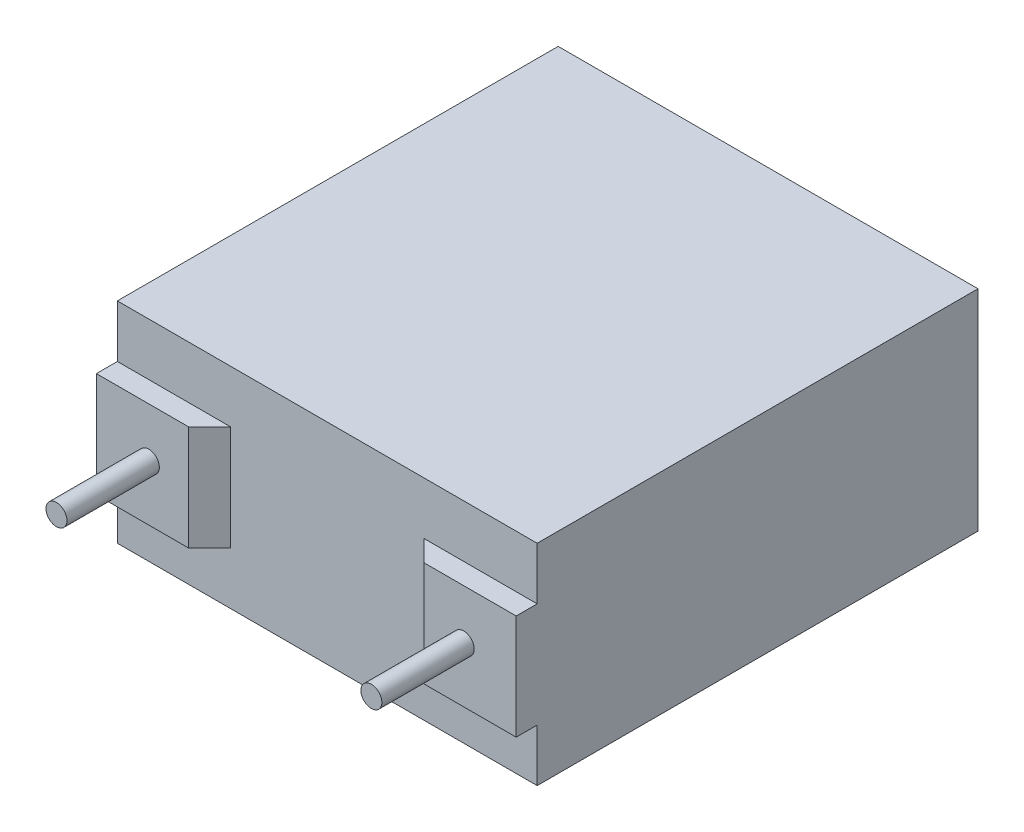
ISO-10303-21;
HEADER;
FILE_DESCRIPTION(('STEP AP214'),'2;1');
FILE_NAME('part.step','',(''),(''),'','','');
FILE_SCHEMA(('AUTOMOTIVE_DESIGN { 1 0 10303 214 1 1 1 1 }'));
ENDSEC;
DATA;
#1=APPLICATION_CONTEXT('core data for automotive mechanical design processes');
#2=APPLICATION_PROTOCOL_DEFINITION('international standard','automotive_design',2000,#1);
#3=PRODUCT_CONTEXT('',#1,'mechanical');
#4=PRODUCT('Part','Part','',(#3));
#5=PRODUCT_RELATED_PRODUCT_CATEGORY('part','',(#4));
#6=PRODUCT_DEFINITION_FORMATION('','',#4);
#7=PRODUCT_DEFINITION_CONTEXT('part definition',#1,'design');
#8=PRODUCT_DEFINITION('design','',#6,#7);
#9=PRODUCT_DEFINITION_SHAPE('','',#8);
#10=(LENGTH_UNIT() NAMED_UNIT(*) SI_UNIT(.MILLI.,.METRE.));
#11=(NAMED_UNIT(*) PLANE_ANGLE_UNIT() SI_UNIT($,.RADIAN.));
#12=(NAMED_UNIT(*) SI_UNIT($,.STERADIAN.) SOLID_ANGLE_UNIT());
#13=UNCERTAINTY_MEASURE_WITH_UNIT(LENGTH_MEASURE(1.E-05),#10,'distance_accuracy_value','');
#14=(GEOMETRIC_REPRESENTATION_CONTEXT(3) GLOBAL_UNCERTAINTY_ASSIGNED_CONTEXT((#13)) GLOBAL_UNIT_ASSIGNED_CONTEXT((#10,
#11,#12)) REPRESENTATION_CONTEXT('',''));
#15=CARTESIAN_POINT('',(0.,0.,0.));
#16=DIRECTION('',(0.,0.,1.));
#17=DIRECTION('',(1.,0.,0.));
#18=AXIS2_PLACEMENT_3D('',#15,#16,#17);
#19=CARTESIAN_POINT('',(5.,-1.25,0.5));
#20=DIRECTION('',(0.,0.,-1.));
#21=DIRECTION('',(-1.,0.,0.));
#22=AXIS2_PLACEMENT_3D('',#19,#20,#21);
#23=PLANE('',#22);
#24=DIRECTION('',(0.,1.,0.));
#25=VECTOR('',#24,1.);
#26=CARTESIAN_POINT('',(5.,1.25,0.5));
#27=LINE('',#26,#25);
#28=CARTESIAN_POINT('',(5.,-1.25,0.5));
#29=VERTEX_POINT('',#28);
#30=CARTESIAN_POINT('',(5.,1.25,0.5));
#31=VERTEX_POINT('',#30);
#32=EDGE_CURVE('E133',#29,#31,#27,.T.);
#33=ORIENTED_EDGE('',*,*,#32,.T.);
#34=DIRECTION('',(-1.,0.,0.));
#35=VECTOR('',#34,1.);
#36=CARTESIAN_POINT('',(5.,1.25,0.5));
#37=LINE('',#36,#35);
#38=CARTESIAN_POINT('',(2.8,1.25,0.5));
#39=VERTEX_POINT('',#38);
#40=EDGE_CURVE('E122',#31,#39,#37,.T.);
#41=ORIENTED_EDGE('',*,*,#40,.T.);
#42=DIRECTION('',(0.,-1.,0.));
#43=VECTOR('',#42,1.);
#44=CARTESIAN_POINT('',(2.8,1.25,0.5));
#45=LINE('',#44,#43);
#46=CARTESIAN_POINT('',(2.8,-1.25,0.5));
#47=VERTEX_POINT('',#46);
#48=EDGE_CURVE('E132',#39,#47,#45,.T.);
#49=ORIENTED_EDGE('',*,*,#48,.T.);
#50=DIRECTION('',(1.,0.,0.));
#51=VECTOR('',#50,1.);
#52=CARTESIAN_POINT('',(5.,-1.25,0.5));
#53=LINE('',#52,#51);
#54=EDGE_CURVE('E138',#47,#29,#53,.T.);
#55=ORIENTED_EDGE('',*,*,#54,.T.);
#56=EDGE_LOOP('',(#33,#41,#49,#55));
#57=FACE_BOUND('',#56,.T.);
#58=CARTESIAN_POINT('',(3.75,0.0659471881858112,0.5));
#59=DIRECTION('',(0.,0.,-1.));
#60=DIRECTION('',(-1.,0.,0.));
#61=AXIS2_PLACEMENT_3D('',#58,#59,#60);
#62=CIRCLE('',#61,0.25);
#63=CARTESIAN_POINT('',(3.5,0.0659471881858112,0.5));
#64=VERTEX_POINT('',#63);
#65=EDGE_CURVE('E11',#64,#64,#62,.F.);
#66=ORIENTED_EDGE('',*,*,#65,.F.);
#67=EDGE_LOOP('',(#66));
#68=FACE_BOUND('',#67,.T.);
#69=ADVANCED_FACE('F35',(#57,#68),#23,.F.);
#70=CARTESIAN_POINT('',(-5.,-1.25,0.5));
#71=DIRECTION('',(0.,0.,1.));
#72=DIRECTION('',(1.,0.,0.));
#73=AXIS2_PLACEMENT_3D('',#70,#71,#72);
#74=PLANE('',#73);
#75=DIRECTION('',(0.,-1.,0.));
#76=VECTOR('',#75,1.);
#77=CARTESIAN_POINT('',(-5.,1.25,0.5));
#78=LINE('',#77,#76);
#79=CARTESIAN_POINT('',(-5.,1.25,0.5));
#80=VERTEX_POINT('',#79);
#81=CARTESIAN_POINT('',(-5.,-1.25,0.5));
#82=VERTEX_POINT('',#81);
#83=EDGE_CURVE('E156',#80,#82,#78,.T.);
#84=ORIENTED_EDGE('',*,*,#83,.T.);
#85=DIRECTION('',(1.,0.,0.));
#86=VECTOR('',#85,1.);
#87=CARTESIAN_POINT('',(-5.,-1.25,0.5));
#88=LINE('',#87,#86);
#89=CARTESIAN_POINT('',(-2.8,-1.25,0.5));
#90=VERTEX_POINT('',#89);
#91=EDGE_CURVE('E159',#82,#90,#88,.T.);
#92=ORIENTED_EDGE('',*,*,#91,.T.);
#93=DIRECTION('',(0.,1.,0.));
#94=VECTOR('',#93,1.);
#95=CARTESIAN_POINT('',(-2.8,1.25,0.5));
#96=LINE('',#95,#94);
#97=CARTESIAN_POINT('',(-2.8,1.25,0.5));
#98=VERTEX_POINT('',#97);
#99=EDGE_CURVE('E162',#90,#98,#96,.T.);
#100=ORIENTED_EDGE('',*,*,#99,.T.);
#101=DIRECTION('',(-1.,0.,0.));
#102=VECTOR('',#101,1.);
#103=CARTESIAN_POINT('',(-5.,1.25,0.5));
#104=LINE('',#103,#102);
#105=EDGE_CURVE('E165',#98,#80,#104,.T.);
#106=ORIENTED_EDGE('',*,*,#105,.T.);
#107=EDGE_LOOP('',(#84,#92,#100,#106));
#108=FACE_BOUND('',#107,.T.);
#109=CARTESIAN_POINT('',(-3.75,0.0659471881858103,0.5));
#110=DIRECTION('',(0.,0.,1.));
#111=DIRECTION('',(1.,0.,0.));
#112=AXIS2_PLACEMENT_3D('',#109,#110,#111);
#113=CIRCLE('',#112,0.25);
#114=CARTESIAN_POINT('',(-3.5,0.0659471881858103,0.5));
#115=VERTEX_POINT('',#114);
#116=EDGE_CURVE('E455',#115,#115,#113,.T.);
#117=ORIENTED_EDGE('',*,*,#116,.F.);
#118=EDGE_LOOP('',(#117));
#119=FACE_BOUND('',#118,.T.);
#120=ADVANCED_FACE('F202',(#108,#119),#74,.T.);
#121=CARTESIAN_POINT('',(-5.,-2.5,0.));
#122=DIRECTION('',(0.,0.,1.));
#123=DIRECTION('',(1.,0.,0.));
#124=AXIS2_PLACEMENT_3D('',#121,#122,#123);
#125=PLANE('',#124);
#126=DIRECTION('',(1.,0.,0.));
#127=VECTOR('',#126,1.);
#128=CARTESIAN_POINT('',(5.,-1.25,0.));
#129=LINE('',#128,#127);
#130=CARTESIAN_POINT('',(2.3,-1.25,0.));
#131=VERTEX_POINT('',#130);
#132=CARTESIAN_POINT('',(5.,-1.25,0.));
#133=VERTEX_POINT('',#132);
#134=EDGE_CURVE('E50',#131,#133,#129,.T.);
#135=ORIENTED_EDGE('',*,*,#134,.F.);
#136=DIRECTION('',(0.,1.,0.));
#137=VECTOR('',#136,1.);
#138=CARTESIAN_POINT('',(2.3,-2.5,0.));
#139=LINE('',#138,#137);
#140=CARTESIAN_POINT('',(2.3,1.25,0.));
#141=VERTEX_POINT('',#140);
#142=EDGE_CURVE('E186',#131,#141,#139,.T.);
#143=ORIENTED_EDGE('',*,*,#142,.T.);
#144=DIRECTION('',(-1.,0.,0.));
#145=VECTOR('',#144,1.);
#146=CARTESIAN_POINT('',(5.,1.25,0.));
#147=LINE('',#146,#145);
#148=CARTESIAN_POINT('',(5.,1.25,0.));
#149=VERTEX_POINT('',#148);
#150=EDGE_CURVE('E58',#149,#141,#147,.T.);
#151=ORIENTED_EDGE('',*,*,#150,.F.);
#152=DIRECTION('',(0.,1.,0.));
#153=VECTOR('',#152,1.);
#154=CARTESIAN_POINT('',(5.,2.5,0.));
#155=LINE('',#154,#153);
#156=CARTESIAN_POINT('',(5.,2.5,0.));
#157=VERTEX_POINT('',#156);
#158=EDGE_CURVE('E147',#149,#157,#155,.T.);
#159=ORIENTED_EDGE('',*,*,#158,.T.);
#160=DIRECTION('',(-1.,0.,0.));
#161=VECTOR('',#160,1.);
#162=CARTESIAN_POINT('',(-5.,2.5,0.));
#163=LINE('',#162,#161);
#164=CARTESIAN_POINT('',(-5.,2.5,0.));
#165=VERTEX_POINT('',#164);
#166=EDGE_CURVE('E234',#157,#165,#163,.T.);
#167=ORIENTED_EDGE('',*,*,#166,.T.);
#168=DIRECTION('',(0.,-1.,0.));
#169=VECTOR('',#168,1.);
#170=CARTESIAN_POINT('',(-5.,2.5,0.));
#171=LINE('',#170,#169);
#172=CARTESIAN_POINT('',(-5.,1.25,0.));
#173=VERTEX_POINT('',#172);
#174=EDGE_CURVE('E216',#165,#173,#171,.T.);
#175=ORIENTED_EDGE('',*,*,#174,.T.);
#176=DIRECTION('',(-1.,0.,0.));
#177=VECTOR('',#176,1.);
#178=CARTESIAN_POINT('',(-5.,1.25,0.));
#179=LINE('',#178,#177);
#180=CARTESIAN_POINT('',(-2.3,1.25,0.));
#181=VERTEX_POINT('',#180);
#182=EDGE_CURVE('E151',#181,#173,#179,.T.);
#183=ORIENTED_EDGE('',*,*,#182,.F.);
#184=DIRECTION('',(0.,-1.,0.));
#185=VECTOR('',#184,1.);
#186=CARTESIAN_POINT('',(-2.3,-2.5,0.));
#187=LINE('',#186,#185);
#188=CARTESIAN_POINT('',(-2.3,-1.25,0.));
#189=VERTEX_POINT('',#188);
#190=EDGE_CURVE('E183',#181,#189,#187,.T.);
#191=ORIENTED_EDGE('',*,*,#190,.T.);
#192=DIRECTION('',(1.,0.,0.));
#193=VECTOR('',#192,1.);
#194=CARTESIAN_POINT('',(-5.,-1.25,0.));
#195=LINE('',#194,#193);
#196=CARTESIAN_POINT('',(-5.,-1.25,0.));
#197=VERTEX_POINT('',#196);
#198=EDGE_CURVE('E148',#197,#189,#195,.T.);
#199=ORIENTED_EDGE('',*,*,#198,.F.);
#200=CARTESIAN_POINT('',(-5.,-2.5,0.));
#201=VERTEX_POINT('',#200);
#202=EDGE_CURVE('E215',#197,#201,#171,.T.);
#203=ORIENTED_EDGE('',*,*,#202,.T.);
#204=DIRECTION('',(1.,0.,0.));
#205=VECTOR('',#204,1.);
#206=CARTESIAN_POINT('',(-5.,-2.5,0.));
#207=LINE('',#206,#205);
#208=CARTESIAN_POINT('',(5.,-2.5,0.));
#209=VERTEX_POINT('',#208);
#210=EDGE_CURVE('E228',#201,#209,#207,.T.);
#211=ORIENTED_EDGE('',*,*,#210,.T.);
#212=EDGE_CURVE('E232',#209,#133,#155,.T.);
#213=ORIENTED_EDGE('',*,*,#212,.T.);
#214=EDGE_LOOP('',(#135,#143,#151,#159,#167,#175,#183,#191,#199,#203,#211,#213));
#215=FACE_BOUND('',#214,.T.);
#216=ADVANCED_FACE('F272',(#215),#125,.T.);
#217=CARTESIAN_POINT('',(-5.,2.5,-10.5));
#218=DIRECTION('',(-1.,0.,0.));
#219=DIRECTION('',(0.,-1.,0.));
#220=AXIS2_PLACEMENT_3D('',#217,#218,#219);
#221=PLANE('',#220);
#222=ORIENTED_EDGE('',*,*,#174,.F.);
#223=DIRECTION('',(0.,0.,1.));
#224=VECTOR('',#223,1.);
#225=CARTESIAN_POINT('',(-5.,2.5,-10.5));
#226=LINE('',#225,#224);
#227=CARTESIAN_POINT('',(-5.,2.5,-10.5));
#228=VERTEX_POINT('',#227);
#229=EDGE_CURVE('E187',#228,#165,#226,.T.);
#230=ORIENTED_EDGE('',*,*,#229,.F.);
#231=DIRECTION('',(0.,-1.,0.));
#232=VECTOR('',#231,1.);
#233=CARTESIAN_POINT('',(-5.,2.5,-10.5));
#234=LINE('',#233,#232);
#235=CARTESIAN_POINT('',(-5.,-2.5,-10.5));
#236=VERTEX_POINT('',#235);
#237=EDGE_CURVE('E170',#228,#236,#234,.T.);
#238=ORIENTED_EDGE('',*,*,#237,.T.);
#239=DIRECTION('',(0.,0.,1.));
#240=VECTOR('',#239,1.);
#241=CARTESIAN_POINT('',(-5.,-2.5,-10.5));
#242=LINE('',#241,#240);
#243=EDGE_CURVE('E241',#236,#201,#242,.T.);
#244=ORIENTED_EDGE('',*,*,#243,.T.);
#245=ORIENTED_EDGE('',*,*,#202,.F.);
#246=DIRECTION('',(0.,0.,-1.));
#247=VECTOR('',#246,1.);
#248=CARTESIAN_POINT('',(-5.,-1.25,0.5));
#249=LINE('',#248,#247);
#250=EDGE_CURVE('E180',#82,#197,#249,.T.);
#251=ORIENTED_EDGE('',*,*,#250,.F.);
#252=ORIENTED_EDGE('',*,*,#83,.F.);
#253=DIRECTION('',(0.,0.,-1.));
#254=VECTOR('',#253,1.);
#255=CARTESIAN_POINT('',(-5.,1.25,0.5));
#256=LINE('',#255,#254);
#257=EDGE_CURVE('E167',#80,#173,#256,.T.);
#258=ORIENTED_EDGE('',*,*,#257,.T.);
#259=EDGE_LOOP('',(#222,#230,#238,#244,#245,#251,#252,#258));
#260=FACE_BOUND('',#259,.T.);
#261=ADVANCED_FACE('F212',(#260),#221,.T.);
#262=CARTESIAN_POINT('',(-5.,2.5,-10.5));
#263=DIRECTION('',(0.,1.,0.));
#264=DIRECTION('',(-1.,0.,0.));
#265=AXIS2_PLACEMENT_3D('',#262,#263,#264);
#266=PLANE('',#265);
#267=ORIENTED_EDGE('',*,*,#166,.F.);
#268=DIRECTION('',(0.,0.,1.));
#269=VECTOR('',#268,1.);
#270=CARTESIAN_POINT('',(5.,2.5,-10.5));
#271=LINE('',#270,#269);
#272=CARTESIAN_POINT('',(5.,2.5,-10.5));
#273=VERTEX_POINT('',#272);
#274=EDGE_CURVE('E238',#273,#157,#271,.T.);
#275=ORIENTED_EDGE('',*,*,#274,.F.);
#276=DIRECTION('',(-1.,0.,0.));
#277=VECTOR('',#276,1.);
#278=CARTESIAN_POINT('',(-5.,2.5,-10.5));
#279=LINE('',#278,#277);
#280=EDGE_CURVE('E226',#273,#228,#279,.T.);
#281=ORIENTED_EDGE('',*,*,#280,.T.);
#282=ORIENTED_EDGE('',*,*,#229,.T.);
#283=EDGE_LOOP('',(#267,#275,#281,#282));
#284=FACE_BOUND('',#283,.T.);
#285=ADVANCED_FACE('F386',(#284),#266,.T.);
#286=CARTESIAN_POINT('',(5.,2.5,-10.5));
#287=DIRECTION('',(1.,0.,0.));
#288=DIRECTION('',(0.,1.,0.));
#289=AXIS2_PLACEMENT_3D('',#286,#287,#288);
#290=PLANE('',#289);
#291=ORIENTED_EDGE('',*,*,#212,.F.);
#292=DIRECTION('',(0.,0.,1.));
#293=VECTOR('',#292,1.);
#294=CARTESIAN_POINT('',(5.,-2.5,-10.5));
#295=LINE('',#294,#293);
#296=CARTESIAN_POINT('',(5.,-2.5,-10.5));
#297=VERTEX_POINT('',#296);
#298=EDGE_CURVE('E240',#297,#209,#295,.T.);
#299=ORIENTED_EDGE('',*,*,#298,.F.);
#300=DIRECTION('',(0.,1.,0.));
#301=VECTOR('',#300,1.);
#302=CARTESIAN_POINT('',(5.,2.5,-10.5));
#303=LINE('',#302,#301);
#304=EDGE_CURVE('E245',#297,#273,#303,.T.);
#305=ORIENTED_EDGE('',*,*,#304,.T.);
#306=ORIENTED_EDGE('',*,*,#274,.T.);
#307=ORIENTED_EDGE('',*,*,#158,.F.);
#308=DIRECTION('',(0.,0.,-1.));
#309=VECTOR('',#308,1.);
#310=CARTESIAN_POINT('',(5.,1.25,0.5));
#311=LINE('',#310,#309);
#312=EDGE_CURVE('E126',#31,#149,#311,.T.);
#313=ORIENTED_EDGE('',*,*,#312,.F.);
#314=ORIENTED_EDGE('',*,*,#32,.F.);
#315=DIRECTION('',(0.,0.,-1.));
#316=VECTOR('',#315,1.);
#317=CARTESIAN_POINT('',(5.,-1.25,0.5));
#318=LINE('',#317,#316);
#319=EDGE_CURVE('E149',#29,#133,#318,.T.);
#320=ORIENTED_EDGE('',*,*,#319,.T.);
#321=EDGE_LOOP('',(#291,#299,#305,#306,#307,#313,#314,#320));
#322=FACE_BOUND('',#321,.T.);
#323=ADVANCED_FACE('F145',(#322),#290,.T.);
#324=CARTESIAN_POINT('',(-5.,-2.5,-10.5));
#325=DIRECTION('',(0.,-1.,0.));
#326=DIRECTION('',(1.,0.,0.));
#327=AXIS2_PLACEMENT_3D('',#324,#325,#326);
#328=PLANE('',#327);
#329=ORIENTED_EDGE('',*,*,#210,.F.);
#330=ORIENTED_EDGE('',*,*,#243,.F.);
#331=DIRECTION('',(1.,0.,0.));
#332=VECTOR('',#331,1.);
#333=CARTESIAN_POINT('',(-5.,-2.5,-10.5));
#334=LINE('',#333,#332);
#335=EDGE_CURVE('E249',#236,#297,#334,.T.);
#336=ORIENTED_EDGE('',*,*,#335,.T.);
#337=ORIENTED_EDGE('',*,*,#298,.T.);
#338=EDGE_LOOP('',(#329,#330,#336,#337));
#339=FACE_BOUND('',#338,.T.);
#340=ADVANCED_FACE('F258',(#339),#328,.T.);
#341=CARTESIAN_POINT('',(-5.,-2.5,-10.5));
#342=DIRECTION('',(0.,0.,1.));
#343=DIRECTION('',(1.,0.,0.));
#344=AXIS2_PLACEMENT_3D('',#341,#342,#343);
#345=PLANE('',#344);
#346=ORIENTED_EDGE('',*,*,#237,.F.);
#347=ORIENTED_EDGE('',*,*,#280,.F.);
#348=ORIENTED_EDGE('',*,*,#304,.F.);
#349=ORIENTED_EDGE('',*,*,#335,.F.);
#350=EDGE_LOOP('',(#346,#347,#348,#349));
#351=FACE_BOUND('',#350,.T.);
#352=ADVANCED_FACE('F256',(#351),#345,.F.);
#353=CARTESIAN_POINT('',(-5.,-1.25,0.5));
#354=DIRECTION('',(0.,1.,0.));
#355=DIRECTION('',(-1.,0.,0.));
#356=AXIS2_PLACEMENT_3D('',#353,#354,#355);
#357=PLANE('',#356);
#358=ORIENTED_EDGE('',*,*,#198,.T.);
#359=DIRECTION('',(-0.707106781186543,0.,0.707106781186552));
#360=VECTOR('',#359,1.);
#361=CARTESIAN_POINT('',(-3.89999999999998,-1.25,1.6));
#362=LINE('',#361,#360);
#363=EDGE_CURVE('E43',#189,#90,#362,.T.);
#364=ORIENTED_EDGE('',*,*,#363,.T.);
#365=ORIENTED_EDGE('',*,*,#91,.F.);
#366=ORIENTED_EDGE('',*,*,#250,.T.);
#367=EDGE_LOOP('',(#358,#364,#365,#366));
#368=FACE_BOUND('',#367,.T.);
#369=ADVANCED_FACE('F196',(#368),#357,.F.);
#370=CARTESIAN_POINT('',(-5.,1.25,0.5));
#371=DIRECTION('',(0.,-1.,0.));
#372=DIRECTION('',(0.,0.,-1.));
#373=AXIS2_PLACEMENT_3D('',#370,#371,#372);
#374=PLANE('',#373);
#375=ORIENTED_EDGE('',*,*,#182,.T.);
#376=ORIENTED_EDGE('',*,*,#257,.F.);
#377=ORIENTED_EDGE('',*,*,#105,.F.);
#378=DIRECTION('',(0.707106781186543,0.,-0.707106781186552));
#379=VECTOR('',#378,1.);
#380=CARTESIAN_POINT('',(-3.89999999999998,1.25,1.6));
#381=LINE('',#380,#379);
#382=EDGE_CURVE('E192',#98,#181,#381,.T.);
#383=ORIENTED_EDGE('',*,*,#382,.T.);
#384=EDGE_LOOP('',(#375,#376,#377,#383));
#385=FACE_BOUND('',#384,.T.);
#386=ADVANCED_FACE('F208',(#385),#374,.F.);
#387=CARTESIAN_POINT('',(5.,1.25,0.5));
#388=DIRECTION('',(0.,-1.,0.));
#389=DIRECTION('',(1.,0.,0.));
#390=AXIS2_PLACEMENT_3D('',#387,#388,#389);
#391=PLANE('',#390);
#392=ORIENTED_EDGE('',*,*,#150,.T.);
#393=DIRECTION('',(0.707106781186542,0.,0.707106781186553));
#394=VECTOR('',#393,1.);
#395=CARTESIAN_POINT('',(3.89999999999998,1.25,1.6));
#396=LINE('',#395,#394);
#397=EDGE_CURVE('E128',#141,#39,#396,.T.);
#398=ORIENTED_EDGE('',*,*,#397,.T.);
#399=ORIENTED_EDGE('',*,*,#40,.F.);
#400=ORIENTED_EDGE('',*,*,#312,.T.);
#401=EDGE_LOOP('',(#392,#398,#399,#400));
#402=FACE_BOUND('',#401,.T.);
#403=ADVANCED_FACE('F124',(#402),#391,.F.);
#404=CARTESIAN_POINT('',(5.,-1.25,0.5));
#405=DIRECTION('',(0.,1.,0.));
#406=DIRECTION('',(-1.,0.,0.));
#407=AXIS2_PLACEMENT_3D('',#404,#405,#406);
#408=PLANE('',#407);
#409=ORIENTED_EDGE('',*,*,#134,.T.);
#410=ORIENTED_EDGE('',*,*,#319,.F.);
#411=ORIENTED_EDGE('',*,*,#54,.F.);
#412=DIRECTION('',(-0.707106781186542,0.,-0.707106781186553));
#413=VECTOR('',#412,1.);
#414=CARTESIAN_POINT('',(3.89999999999998,-1.25,1.6));
#415=LINE('',#414,#413);
#416=EDGE_CURVE('E189',#47,#131,#415,.T.);
#417=ORIENTED_EDGE('',*,*,#416,.T.);
#418=EDGE_LOOP('',(#409,#410,#411,#417));
#419=FACE_BOUND('',#418,.T.);
#420=ADVANCED_FACE('F278',(#419),#408,.F.);
#421=CARTESIAN_POINT('',(2.8,1.25,0.500000000000004));
#422=DIRECTION('',(0.707106781186553,0.,-0.707106781186542));
#423=DIRECTION('',(-0.707106781186542,0.,-0.707106781186553));
#424=AXIS2_PLACEMENT_3D('',#421,#422,#423);
#425=PLANE('',#424);
#426=ORIENTED_EDGE('',*,*,#397,.F.);
#427=ORIENTED_EDGE('',*,*,#142,.F.);
#428=ORIENTED_EDGE('',*,*,#416,.F.);
#429=ORIENTED_EDGE('',*,*,#48,.F.);
#430=EDGE_LOOP('',(#426,#427,#428,#429));
#431=FACE_BOUND('',#430,.T.);
#432=ADVANCED_FACE('F281',(#431),#425,.F.);
#433=CARTESIAN_POINT('',(-2.8,1.25,0.500000000000004));
#434=DIRECTION('',(-0.707106781186552,0.,-0.707106781186543));
#435=DIRECTION('',(-0.707106781186543,0.,0.707106781186552));
#436=AXIS2_PLACEMENT_3D('',#433,#434,#435);
#437=PLANE('',#436);
#438=ORIENTED_EDGE('',*,*,#363,.F.);
#439=ORIENTED_EDGE('',*,*,#190,.F.);
#440=ORIENTED_EDGE('',*,*,#382,.F.);
#441=ORIENTED_EDGE('',*,*,#99,.F.);
#442=EDGE_LOOP('',(#438,#439,#440,#441));
#443=FACE_BOUND('',#442,.T.);
#444=ADVANCED_FACE('F37',(#443),#437,.F.);
#445=CARTESIAN_POINT('',(-3.75,0.0659471881858103,2.7));
#446=DIRECTION('',(0.,0.,-1.));
#447=DIRECTION('',(-1.,0.,0.));
#448=AXIS2_PLACEMENT_3D('',#445,#446,#447);
#449=CYLINDRICAL_SURFACE('',#448,0.25);
#450=CARTESIAN_POINT('',(-3.75,0.0659471881858103,2.7));
#451=DIRECTION('',(0.,0.,1.));
#452=DIRECTION('',(1.,0.,0.));
#453=AXIS2_PLACEMENT_3D('',#450,#451,#452);
#454=CIRCLE('',#453,0.25);
#455=CARTESIAN_POINT('',(-3.5,0.0659471881858103,2.7));
#456=VERTEX_POINT('',#455);
#457=EDGE_CURVE('E452',#456,#456,#454,.T.);
#458=ORIENTED_EDGE('',*,*,#457,.F.);
#459=EDGE_LOOP('',(#458));
#460=FACE_BOUND('',#459,.T.);
#461=ORIENTED_EDGE('',*,*,#116,.T.);
#462=EDGE_LOOP('',(#461));
#463=FACE_BOUND('',#462,.T.);
#464=ADVANCED_FACE('F276',(#460,#463),#449,.T.);
#465=CARTESIAN_POINT('',(-3.75,0.0659471881858103,2.7));
#466=DIRECTION('',(0.,0.,1.));
#467=DIRECTION('',(1.,0.,0.));
#468=AXIS2_PLACEMENT_3D('',#465,#466,#467);
#469=PLANE('',#468);
#470=ORIENTED_EDGE('',*,*,#457,.T.);
#471=EDGE_LOOP('',(#470));
#472=FACE_BOUND('',#471,.T.);
#473=ADVANCED_FACE('F317',(#472),#469,.T.);
#474=CARTESIAN_POINT('',(3.75,0.0659471881858112,2.7));
#475=DIRECTION('',(0.,0.,-1.));
#476=DIRECTION('',(-1.,0.,0.));
#477=AXIS2_PLACEMENT_3D('',#474,#475,#476);
#478=CYLINDRICAL_SURFACE('',#477,0.25);
#479=CARTESIAN_POINT('',(3.75,0.0659471881858112,2.7));
#480=DIRECTION('',(0.,0.,1.));
#481=DIRECTION('',(-1.,0.,0.));
#482=AXIS2_PLACEMENT_3D('',#479,#480,#481);
#483=CIRCLE('',#482,0.25);
#484=CARTESIAN_POINT('',(3.5,0.0659471881858112,2.7));
#485=VERTEX_POINT('',#484);
#486=EDGE_CURVE('E461',#485,#485,#483,.T.);
#487=ORIENTED_EDGE('',*,*,#486,.F.);
#488=EDGE_LOOP('',(#487));
#489=FACE_BOUND('',#488,.T.);
#490=ORIENTED_EDGE('',*,*,#65,.T.);
#491=EDGE_LOOP('',(#490));
#492=FACE_BOUND('',#491,.T.);
#493=ADVANCED_FACE('F325',(#489,#492),#478,.T.);
#494=CARTESIAN_POINT('',(3.75,0.0659471881858112,2.7));
#495=DIRECTION('',(0.,0.,-1.));
#496=DIRECTION('',(-1.,0.,0.));
#497=AXIS2_PLACEMENT_3D('',#494,#495,#496);
#498=PLANE('',#497);
#499=ORIENTED_EDGE('',*,*,#486,.T.);
#500=EDGE_LOOP('',(#499));
#501=FACE_BOUND('',#500,.T.);
#502=ADVANCED_FACE('F332',(#501),#498,.F.);
#503=CLOSED_SHELL('',(#69,#120,#216,#261,#285,#323,#340,#352,#369,#386,#403,#420,#432,#444,#464,
#473,#493,#502));
#504=MANIFOLD_SOLID_BREP('B2',#503);
#505=ADVANCED_BREP_SHAPE_REPRESENTATION('',(#18,#504),#14);
#506=SHAPE_DEFINITION_REPRESENTATION(#9,#505);
ENDSEC;
END-ISO-10303-21;
